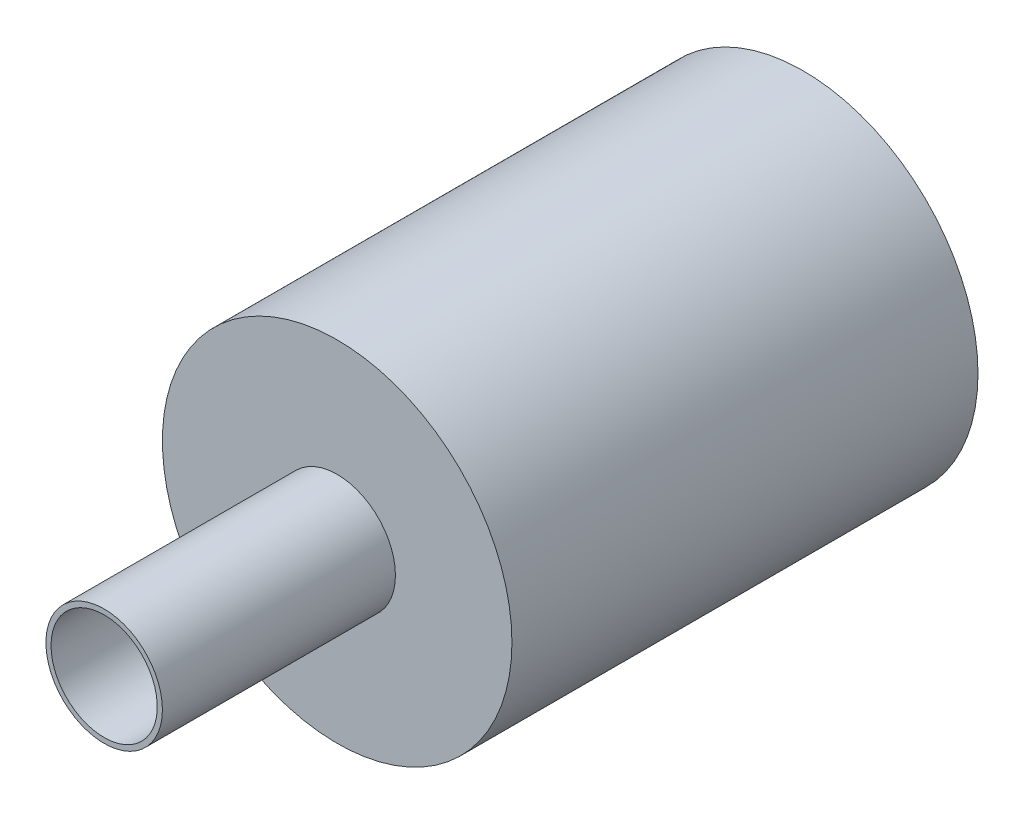
ISO-10303-21;
HEADER;
FILE_DESCRIPTION(('STEP AP214'),'2;1');
FILE_NAME('part.step','',(''),(''),'','','');
FILE_SCHEMA(('AUTOMOTIVE_DESIGN { 1 0 10303 214 1 1 1 1 }'));
ENDSEC;
DATA;
#1=APPLICATION_CONTEXT('core data for automotive mechanical design processes');
#2=APPLICATION_PROTOCOL_DEFINITION('international standard','automotive_design',2000,#1);
#3=PRODUCT_CONTEXT('',#1,'mechanical');
#4=PRODUCT('Part','Part','',(#3));
#5=PRODUCT_RELATED_PRODUCT_CATEGORY('part','',(#4));
#6=PRODUCT_DEFINITION_FORMATION('','',#4);
#7=PRODUCT_DEFINITION_CONTEXT('part definition',#1,'design');
#8=PRODUCT_DEFINITION('design','',#6,#7);
#9=PRODUCT_DEFINITION_SHAPE('','',#8);
#10=(LENGTH_UNIT() NAMED_UNIT(*) SI_UNIT(.MILLI.,.METRE.));
#11=(NAMED_UNIT(*) PLANE_ANGLE_UNIT() SI_UNIT($,.RADIAN.));
#12=(NAMED_UNIT(*) SI_UNIT($,.STERADIAN.) SOLID_ANGLE_UNIT());
#13=UNCERTAINTY_MEASURE_WITH_UNIT(LENGTH_MEASURE(1.E-05),#10,'distance_accuracy_value','');
#14=(GEOMETRIC_REPRESENTATION_CONTEXT(3) GLOBAL_UNCERTAINTY_ASSIGNED_CONTEXT((#13)) GLOBAL_UNIT_ASSIGNED_CONTEXT((#10,
#11,#12)) REPRESENTATION_CONTEXT('',''));
#15=CARTESIAN_POINT('',(0.,0.,0.));
#16=DIRECTION('',(0.,0.,1.));
#17=DIRECTION('',(1.,0.,0.));
#18=AXIS2_PLACEMENT_3D('',#15,#16,#17);
#19=CARTESIAN_POINT('',(0.,0.,25.4));
#20=DIRECTION('',(0.,0.,-1.));
#21=DIRECTION('',(-1.,0.,0.));
#22=AXIS2_PLACEMENT_3D('',#19,#20,#21);
#23=CYLINDRICAL_SURFACE('',#22,9.525);
#24=CARTESIAN_POINT('',(0.,0.,25.4));
#25=DIRECTION('',(0.,0.,1.));
#26=DIRECTION('',(1.,0.,0.));
#27=AXIS2_PLACEMENT_3D('',#24,#25,#26);
#28=CIRCLE('',#27,9.525);
#29=CARTESIAN_POINT('',(9.525,0.,25.4));
#30=VERTEX_POINT('',#29);
#31=EDGE_CURVE('E41',#30,#30,#28,.T.);
#32=ORIENTED_EDGE('',*,*,#31,.F.);
#33=EDGE_LOOP('',(#32));
#34=FACE_BOUND('',#33,.T.);
#35=CARTESIAN_POINT('',(0.,0.,0.));
#36=DIRECTION('',(0.,0.,1.));
#37=DIRECTION('',(1.,0.,0.));
#38=AXIS2_PLACEMENT_3D('',#35,#36,#37);
#39=CIRCLE('',#38,9.525);
#40=CARTESIAN_POINT('',(9.525,0.,0.));
#41=VERTEX_POINT('',#40);
#42=EDGE_CURVE('E46',#41,#41,#39,.T.);
#43=ORIENTED_EDGE('',*,*,#42,.T.);
#44=EDGE_LOOP('',(#43));
#45=FACE_BOUND('',#44,.T.);
#46=ADVANCED_FACE('F34',(#34,#45),#23,.T.);
#47=CARTESIAN_POINT('',(0.,0.,25.4));
#48=DIRECTION('',(0.,0.,1.));
#49=DIRECTION('',(1.,0.,0.));
#50=AXIS2_PLACEMENT_3D('',#47,#48,#49);
#51=PLANE('',#50);
#52=CARTESIAN_POINT('',(0.,0.,25.4));
#53=DIRECTION('',(0.,0.,1.));
#54=DIRECTION('',(1.,0.,0.));
#55=AXIS2_PLACEMENT_3D('',#52,#53,#54);
#56=CIRCLE('',#55,3.175);
#57=CARTESIAN_POINT('',(3.175,0.,25.4));
#58=VERTEX_POINT('',#57);
#59=EDGE_CURVE('E10',#58,#58,#56,.T.);
#60=ORIENTED_EDGE('',*,*,#59,.F.);
#61=EDGE_LOOP('',(#60));
#62=FACE_BOUND('',#61,.T.);
#63=ORIENTED_EDGE('',*,*,#31,.T.);
#64=EDGE_LOOP('',(#63));
#65=FACE_BOUND('',#64,.T.);
#66=ADVANCED_FACE('F76',(#62,#65),#51,.T.);
#67=CARTESIAN_POINT('',(0.,0.,0.));
#68=DIRECTION('',(0.,0.,1.));
#69=DIRECTION('',(1.,0.,0.));
#70=AXIS2_PLACEMENT_3D('',#67,#68,#69);
#71=PLANE('',#70);
#72=CARTESIAN_POINT('',(0.,0.,0.));
#73=DIRECTION('',(0.,0.,-1.));
#74=DIRECTION('',(0.,1.,0.));
#75=AXIS2_PLACEMENT_3D('',#72,#73,#74);
#76=CIRCLE('',#75,6.94537599999999);
#77=CARTESIAN_POINT('',(0.,6.94537599999999,0.));
#78=VERTEX_POINT('',#77);
#79=EDGE_CURVE('E66',#78,#78,#76,.T.);
#80=ORIENTED_EDGE('',*,*,#79,.F.);
#81=EDGE_LOOP('',(#80));
#82=FACE_BOUND('',#81,.T.);
#83=ORIENTED_EDGE('',*,*,#42,.F.);
#84=EDGE_LOOP('',(#83));
#85=FACE_BOUND('',#84,.T.);
#86=ADVANCED_FACE('F72',(#82,#85),#71,.F.);
#87=CARTESIAN_POINT('',(0.,0.,38.1));
#88=DIRECTION('',(0.,0.,-1.));
#89=DIRECTION('',(-1.,0.,0.));
#90=AXIS2_PLACEMENT_3D('',#87,#88,#89);
#91=CYLINDRICAL_SURFACE('',#90,3.175);
#92=CARTESIAN_POINT('',(0.,0.,38.1));
#93=DIRECTION('',(0.,0.,1.));
#94=DIRECTION('',(1.,0.,0.));
#95=AXIS2_PLACEMENT_3D('',#92,#93,#94);
#96=CIRCLE('',#95,3.175);
#97=CARTESIAN_POINT('',(3.175,0.,38.1));
#98=VERTEX_POINT('',#97);
#99=EDGE_CURVE('E49',#98,#98,#96,.T.);
#100=ORIENTED_EDGE('',*,*,#99,.F.);
#101=EDGE_LOOP('',(#100));
#102=FACE_BOUND('',#101,.T.);
#103=ORIENTED_EDGE('',*,*,#59,.T.);
#104=EDGE_LOOP('',(#103));
#105=FACE_BOUND('',#104,.T.);
#106=ADVANCED_FACE('F75',(#102,#105),#91,.T.);
#107=CARTESIAN_POINT('',(0.,0.,38.1));
#108=DIRECTION('',(0.,0.,1.));
#109=DIRECTION('',(1.,0.,0.));
#110=AXIS2_PLACEMENT_3D('',#107,#108,#109);
#111=PLANE('',#110);
#112=CARTESIAN_POINT('',(0.,0.,38.1));
#113=DIRECTION('',(0.,0.,-1.));
#114=DIRECTION('',(-1.,0.,0.));
#115=AXIS2_PLACEMENT_3D('',#112,#113,#114);
#116=CIRCLE('',#115,2.89559999999998);
#117=CARTESIAN_POINT('',(-2.89559999999998,0.,38.1));
#118=VERTEX_POINT('',#117);
#119=EDGE_CURVE('E55',#118,#118,#116,.T.);
#120=ORIENTED_EDGE('',*,*,#119,.T.);
#121=EDGE_LOOP('',(#120));
#122=FACE_BOUND('',#121,.T.);
#123=ORIENTED_EDGE('',*,*,#99,.T.);
#124=EDGE_LOOP('',(#123));
#125=FACE_BOUND('',#124,.T.);
#126=ADVANCED_FACE('F82',(#122,#125),#111,.T.);
#127=CARTESIAN_POINT('',(0.,0.,0.));
#128=DIRECTION('',(0.,0.,-1.));
#129=DIRECTION('',(-1.,0.,0.));
#130=AXIS2_PLACEMENT_3D('',#127,#128,#129);
#131=CYLINDRICAL_SURFACE('',#130,2.89559999999999);
#132=CARTESIAN_POINT('',(0.,0.,21.229350914283));
#133=DIRECTION('',(0.,0.,-1.));
#134=DIRECTION('',(0.,1.,0.));
#135=AXIS2_PLACEMENT_3D('',#132,#133,#134);
#136=CIRCLE('',#135,2.89559999999999);
#137=CARTESIAN_POINT('',(0.,2.89559999999999,21.229350914283));
#138=VERTEX_POINT('',#137);
#139=EDGE_CURVE('E37',#138,#138,#136,.T.);
#140=ORIENTED_EDGE('',*,*,#139,.T.);
#141=EDGE_LOOP('',(#140));
#142=FACE_BOUND('',#141,.T.);
#143=ORIENTED_EDGE('',*,*,#119,.F.);
#144=EDGE_LOOP('',(#143));
#145=FACE_BOUND('',#144,.T.);
#146=ADVANCED_FACE('F111',(#142,#145),#131,.F.);
#147=CARTESIAN_POINT('',(0.,0.,18.796));
#148=DIRECTION('',(0.,0.,-1.));
#149=DIRECTION('',(0.,1.,0.));
#150=AXIS2_PLACEMENT_3D('',#147,#148,#149);
#151=CONICAL_SURFACE('',#150,6.94537599999999,1.02974425867665);
#152=CARTESIAN_POINT('',(0.,0.,18.796));
#153=DIRECTION('',(0.,0.,-1.));
#154=DIRECTION('',(0.,1.,0.));
#155=AXIS2_PLACEMENT_3D('',#152,#153,#154);
#156=CIRCLE('',#155,6.94537599999999);
#157=CARTESIAN_POINT('',(0.,6.94537599999999,18.796));
#158=VERTEX_POINT('',#157);
#159=EDGE_CURVE('E62',#158,#158,#156,.T.);
#160=ORIENTED_EDGE('',*,*,#159,.T.);
#161=EDGE_LOOP('',(#160));
#162=FACE_BOUND('',#161,.T.);
#163=ORIENTED_EDGE('',*,*,#139,.F.);
#164=EDGE_LOOP('',(#163));
#165=FACE_BOUND('',#164,.T.);
#166=ADVANCED_FACE('F118',(#162,#165),#151,.F.);
#167=CARTESIAN_POINT('',(0.,0.,0.));
#168=DIRECTION('',(0.,0.,-1.));
#169=DIRECTION('',(0.,1.,0.));
#170=AXIS2_PLACEMENT_3D('',#167,#168,#169);
#171=CYLINDRICAL_SURFACE('',#170,6.94537599999999);
#172=ORIENTED_EDGE('',*,*,#159,.F.);
#173=EDGE_LOOP('',(#172));
#174=FACE_BOUND('',#173,.T.);
#175=ORIENTED_EDGE('',*,*,#79,.T.);
#176=EDGE_LOOP('',(#175));
#177=FACE_BOUND('',#176,.T.);
#178=ADVANCED_FACE('F70',(#174,#177),#171,.F.);
#179=CLOSED_SHELL('',(#46,#66,#86,#106,#126,#146,#166,#178));
#180=MANIFOLD_SOLID_BREP('B2',#179);
#181=ADVANCED_BREP_SHAPE_REPRESENTATION('',(#18,#180),#14);
#182=SHAPE_DEFINITION_REPRESENTATION(#9,#181);
ENDSEC;
END-ISO-10303-21;
